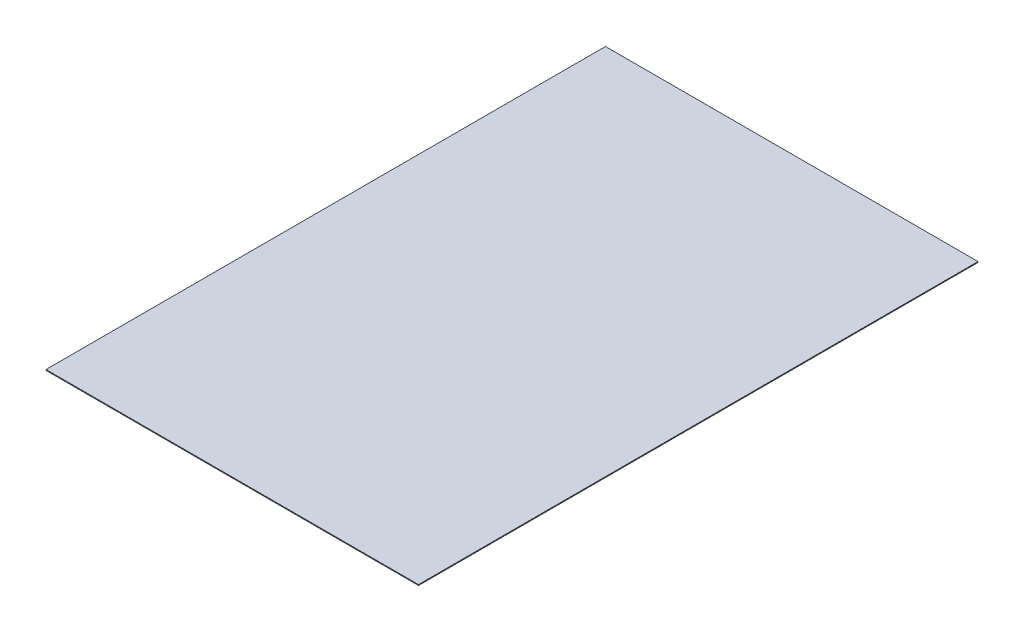
ISO-10303-21;
HEADER;
FILE_DESCRIPTION(('STEP AP214'),'2;1');
FILE_NAME('part.step','',(''),(''),'','','');
FILE_SCHEMA(('AUTOMOTIVE_DESIGN { 1 0 10303 214 1 1 1 1 }'));
ENDSEC;
DATA;
#1=APPLICATION_CONTEXT('core data for automotive mechanical design processes');
#2=APPLICATION_PROTOCOL_DEFINITION('international standard','automotive_design',2000,#1);
#3=PRODUCT_CONTEXT('',#1,'mechanical');
#4=PRODUCT('Part','Part','',(#3));
#5=PRODUCT_RELATED_PRODUCT_CATEGORY('part','',(#4));
#6=PRODUCT_DEFINITION_FORMATION('','',#4);
#7=PRODUCT_DEFINITION_CONTEXT('part definition',#1,'design');
#8=PRODUCT_DEFINITION('design','',#6,#7);
#9=PRODUCT_DEFINITION_SHAPE('','',#8);
#10=(LENGTH_UNIT() NAMED_UNIT(*) SI_UNIT(.MILLI.,.METRE.));
#11=(NAMED_UNIT(*) PLANE_ANGLE_UNIT() SI_UNIT($,.RADIAN.));
#12=(NAMED_UNIT(*) SI_UNIT($,.STERADIAN.) SOLID_ANGLE_UNIT());
#13=UNCERTAINTY_MEASURE_WITH_UNIT(LENGTH_MEASURE(1.E-05),#10,'distance_accuracy_value','');
#14=(GEOMETRIC_REPRESENTATION_CONTEXT(3) GLOBAL_UNCERTAINTY_ASSIGNED_CONTEXT((#13)) GLOBAL_UNIT_ASSIGNED_CONTEXT((#10,
#11,#12)) REPRESENTATION_CONTEXT('',''));
#15=CARTESIAN_POINT('',(0.,0.,0.));
#16=DIRECTION('',(0.,0.,1.));
#17=DIRECTION('',(1.,0.,0.));
#18=AXIS2_PLACEMENT_3D('',#15,#16,#17);
#19=CARTESIAN_POINT('',(-6725.,-15.,-5050.));
#20=DIRECTION('',(-1.,0.,0.));
#21=DIRECTION('',(0.,0.,1.));
#22=AXIS2_PLACEMENT_3D('',#19,#20,#21);
#23=PLANE('',#22);
#24=DIRECTION('',(0.,0.,1.));
#25=VECTOR('',#24,1.);
#26=CARTESIAN_POINT('',(-6725.,0.,-5050.));
#27=LINE('',#26,#25);
#28=CARTESIAN_POINT('',(-6725.,0.,-5050.));
#29=VERTEX_POINT('',#28);
#30=CARTESIAN_POINT('',(-6725.,0.,5050.));
#31=VERTEX_POINT('',#30);
#32=EDGE_CURVE('E111',#29,#31,#27,.T.);
#33=ORIENTED_EDGE('',*,*,#32,.F.);
#34=DIRECTION('',(0.,1.,0.));
#35=VECTOR('',#34,1.);
#36=CARTESIAN_POINT('',(-6725.,-15.,-5050.));
#37=LINE('',#36,#35);
#38=CARTESIAN_POINT('',(-6725.,-15.,-5050.));
#39=VERTEX_POINT('',#38);
#40=EDGE_CURVE('E11',#39,#29,#37,.T.);
#41=ORIENTED_EDGE('',*,*,#40,.F.);
#42=DIRECTION('',(0.,0.,1.));
#43=VECTOR('',#42,1.);
#44=CARTESIAN_POINT('',(-6725.,-15.,-5050.));
#45=LINE('',#44,#43);
#46=CARTESIAN_POINT('',(-6725.,-15.,5050.));
#47=VERTEX_POINT('',#46);
#48=EDGE_CURVE('E103',#39,#47,#45,.T.);
#49=ORIENTED_EDGE('',*,*,#48,.T.);
#50=DIRECTION('',(0.,1.,0.));
#51=VECTOR('',#50,1.);
#52=CARTESIAN_POINT('',(-6725.,-15.,5050.));
#53=LINE('',#52,#51);
#54=EDGE_CURVE('E44',#47,#31,#53,.T.);
#55=ORIENTED_EDGE('',*,*,#54,.T.);
#56=EDGE_LOOP('',(#33,#41,#49,#55));
#57=FACE_BOUND('',#56,.T.);
#58=ADVANCED_FACE('F41',(#57),#23,.T.);
#59=CARTESIAN_POINT('',(-6725.,-15.,-5050.));
#60=DIRECTION('',(0.,0.,-1.));
#61=DIRECTION('',(-1.,0.,0.));
#62=AXIS2_PLACEMENT_3D('',#59,#60,#61);
#63=PLANE('',#62);
#64=DIRECTION('',(-1.,0.,0.));
#65=VECTOR('',#64,1.);
#66=CARTESIAN_POINT('',(-6725.,0.,-5050.));
#67=LINE('',#66,#65);
#68=CARTESIAN_POINT('',(0.,0.,-5050.));
#69=VERTEX_POINT('',#68);
#70=EDGE_CURVE('E106',#69,#29,#67,.T.);
#71=ORIENTED_EDGE('',*,*,#70,.F.);
#72=DIRECTION('',(0.,1.,0.));
#73=VECTOR('',#72,1.);
#74=CARTESIAN_POINT('',(0.,-15.,-5050.));
#75=LINE('',#74,#73);
#76=CARTESIAN_POINT('',(0.,-15.,-5050.));
#77=VERTEX_POINT('',#76);
#78=EDGE_CURVE('E51',#77,#69,#75,.T.);
#79=ORIENTED_EDGE('',*,*,#78,.F.);
#80=DIRECTION('',(-1.,0.,0.));
#81=VECTOR('',#80,1.);
#82=CARTESIAN_POINT('',(-6725.,-15.,-5050.));
#83=LINE('',#82,#81);
#84=EDGE_CURVE('E98',#77,#39,#83,.T.);
#85=ORIENTED_EDGE('',*,*,#84,.T.);
#86=ORIENTED_EDGE('',*,*,#40,.T.);
#87=EDGE_LOOP('',(#71,#79,#85,#86));
#88=FACE_BOUND('',#87,.T.);
#89=ADVANCED_FACE('F127',(#88),#63,.T.);
#90=CARTESIAN_POINT('',(0.,-15.,-5050.));
#91=DIRECTION('',(1.,0.,0.));
#92=DIRECTION('',(0.,0.,-1.));
#93=AXIS2_PLACEMENT_3D('',#90,#91,#92);
#94=PLANE('',#93);
#95=DIRECTION('',(0.,0.,-1.));
#96=VECTOR('',#95,1.);
#97=CARTESIAN_POINT('',(0.,0.,-5050.));
#98=LINE('',#97,#96);
#99=CARTESIAN_POINT('',(8.88178419700125E-13,0.,5050.));
#100=VERTEX_POINT('',#99);
#101=EDGE_CURVE('E92',#100,#69,#98,.T.);
#102=ORIENTED_EDGE('',*,*,#101,.F.);
#103=DIRECTION('',(0.,1.,0.));
#104=VECTOR('',#103,1.);
#105=CARTESIAN_POINT('',(8.88178419700125E-13,-15.,5050.));
#106=LINE('',#105,#104);
#107=CARTESIAN_POINT('',(8.88178419700125E-13,-15.,5050.));
#108=VERTEX_POINT('',#107);
#109=EDGE_CURVE('E87',#108,#100,#106,.T.);
#110=ORIENTED_EDGE('',*,*,#109,.F.);
#111=DIRECTION('',(0.,0.,-1.));
#112=VECTOR('',#111,1.);
#113=CARTESIAN_POINT('',(0.,-15.,-5050.));
#114=LINE('',#113,#112);
#115=EDGE_CURVE('E90',#108,#77,#114,.T.);
#116=ORIENTED_EDGE('',*,*,#115,.T.);
#117=ORIENTED_EDGE('',*,*,#78,.T.);
#118=EDGE_LOOP('',(#102,#110,#116,#117));
#119=FACE_BOUND('',#118,.T.);
#120=ADVANCED_FACE('F89',(#119),#94,.T.);
#121=CARTESIAN_POINT('',(-6725.,-15.,5050.));
#122=DIRECTION('',(0.,0.,1.));
#123=DIRECTION('',(1.,0.,0.));
#124=AXIS2_PLACEMENT_3D('',#121,#122,#123);
#125=PLANE('',#124);
#126=DIRECTION('',(1.,0.,0.));
#127=VECTOR('',#126,1.);
#128=CARTESIAN_POINT('',(-6725.,0.,5050.));
#129=LINE('',#128,#127);
#130=EDGE_CURVE('E115',#31,#100,#129,.T.);
#131=ORIENTED_EDGE('',*,*,#130,.F.);
#132=ORIENTED_EDGE('',*,*,#54,.F.);
#133=DIRECTION('',(1.,0.,0.));
#134=VECTOR('',#133,1.);
#135=CARTESIAN_POINT('',(-6725.,-15.,5050.));
#136=LINE('',#135,#134);
#137=EDGE_CURVE('E97',#47,#108,#136,.T.);
#138=ORIENTED_EDGE('',*,*,#137,.T.);
#139=ORIENTED_EDGE('',*,*,#109,.T.);
#140=EDGE_LOOP('',(#131,#132,#138,#139));
#141=FACE_BOUND('',#140,.T.);
#142=ADVANCED_FACE('F101',(#141),#125,.T.);
#143=CARTESIAN_POINT('',(0.,-15.,0.));
#144=DIRECTION('',(0.,1.,0.));
#145=DIRECTION('',(0.,0.,1.));
#146=AXIS2_PLACEMENT_3D('',#143,#144,#145);
#147=PLANE('',#146);
#148=ORIENTED_EDGE('',*,*,#48,.F.);
#149=ORIENTED_EDGE('',*,*,#84,.F.);
#150=ORIENTED_EDGE('',*,*,#115,.F.);
#151=ORIENTED_EDGE('',*,*,#137,.F.);
#152=EDGE_LOOP('',(#148,#149,#150,#151));
#153=FACE_BOUND('',#152,.T.);
#154=ADVANCED_FACE('F96',(#153),#147,.F.);
#155=CARTESIAN_POINT('',(0.,0.,0.));
#156=DIRECTION('',(0.,1.,0.));
#157=DIRECTION('',(0.,0.,1.));
#158=AXIS2_PLACEMENT_3D('',#155,#156,#157);
#159=PLANE('',#158);
#160=ORIENTED_EDGE('',*,*,#32,.T.);
#161=ORIENTED_EDGE('',*,*,#130,.T.);
#162=ORIENTED_EDGE('',*,*,#101,.T.);
#163=ORIENTED_EDGE('',*,*,#70,.T.);
#164=EDGE_LOOP('',(#160,#161,#162,#163));
#165=FACE_BOUND('',#164,.T.);
#166=ADVANCED_FACE('F126',(#165),#159,.T.);
#167=CLOSED_SHELL('',(#58,#89,#120,#142,#154,#166));
#168=MANIFOLD_SOLID_BREP('B2',#167);
#169=ADVANCED_BREP_SHAPE_REPRESENTATION('',(#18,#168),#14);
#170=SHAPE_DEFINITION_REPRESENTATION(#9,#169);
ENDSEC;
END-ISO-10303-21;
